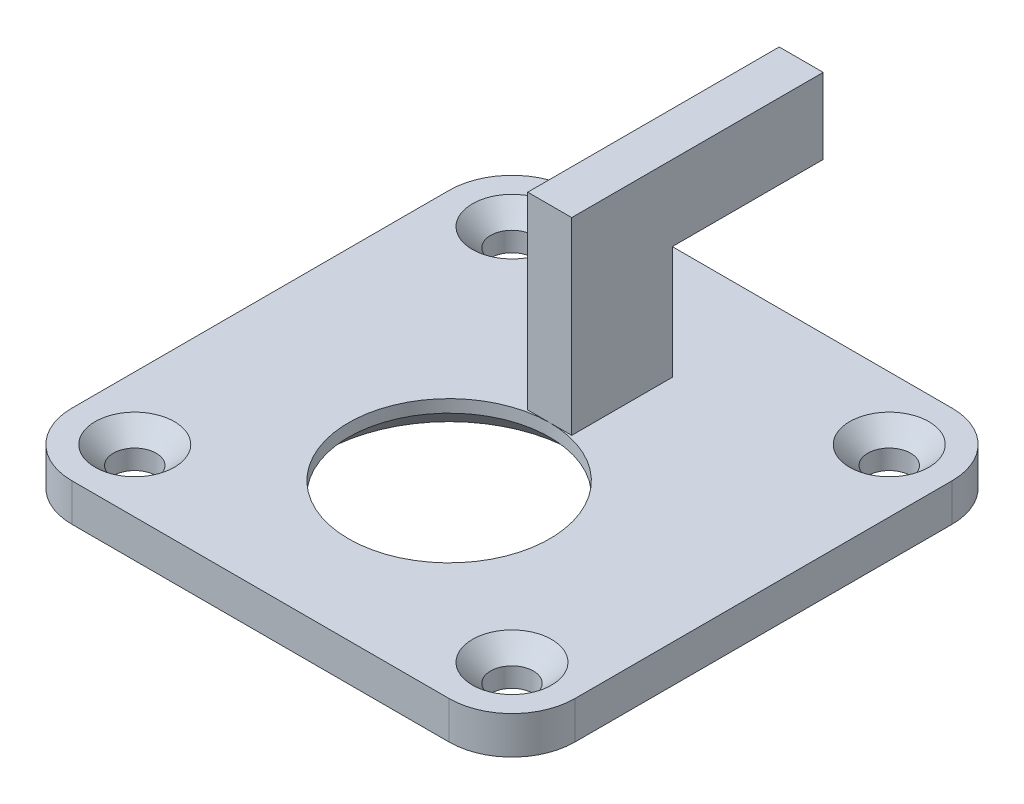
ISO-10303-21;
HEADER;
FILE_DESCRIPTION(('STEP AP214'),'2;1');
FILE_NAME('part.step','',(''),(''),'','','');
FILE_SCHEMA(('AUTOMOTIVE_DESIGN { 1 0 10303 214 1 1 1 1 }'));
ENDSEC;
DATA;
#1=APPLICATION_CONTEXT('core data for automotive mechanical design processes');
#2=APPLICATION_PROTOCOL_DEFINITION('international standard','automotive_design',2000,#1);
#3=PRODUCT_CONTEXT('',#1,'mechanical');
#4=PRODUCT('Part','Part','',(#3));
#5=PRODUCT_RELATED_PRODUCT_CATEGORY('part','',(#4));
#6=PRODUCT_DEFINITION_FORMATION('','',#4);
#7=PRODUCT_DEFINITION_CONTEXT('part definition',#1,'design');
#8=PRODUCT_DEFINITION('design','',#6,#7);
#9=PRODUCT_DEFINITION_SHAPE('','',#8);
#10=(LENGTH_UNIT() NAMED_UNIT(*) SI_UNIT(.MILLI.,.METRE.));
#11=(NAMED_UNIT(*) PLANE_ANGLE_UNIT() SI_UNIT($,.RADIAN.));
#12=(NAMED_UNIT(*) SI_UNIT($,.STERADIAN.) SOLID_ANGLE_UNIT());
#13=UNCERTAINTY_MEASURE_WITH_UNIT(LENGTH_MEASURE(1.E-05),#10,'distance_accuracy_value','');
#14=(GEOMETRIC_REPRESENTATION_CONTEXT(3) GLOBAL_UNCERTAINTY_ASSIGNED_CONTEXT((#13)) GLOBAL_UNIT_ASSIGNED_CONTEXT((#10,
#11,#12)) REPRESENTATION_CONTEXT('',''));
#15=CARTESIAN_POINT('',(0.,0.,0.));
#16=DIRECTION('',(0.,0.,1.));
#17=DIRECTION('',(1.,0.,0.));
#18=AXIS2_PLACEMENT_3D('',#15,#16,#17);
#19=CARTESIAN_POINT('',(15.,0.,-20.));
#20=DIRECTION('',(0.,1.,0.));
#21=DIRECTION('',(0.,0.,1.));
#22=AXIS2_PLACEMENT_3D('',#19,#20,#21);
#23=PLANE('',#22);
#24=CARTESIAN_POINT('',(-15.,0.,-20.));
#25=DIRECTION('',(0.,1.,0.));
#26=DIRECTION('',(0.,0.,1.));
#27=AXIS2_PLACEMENT_3D('',#24,#25,#26);
#28=CIRCLE('',#27,3.15);
#29=CARTESIAN_POINT('',(-15.,0.,-16.85));
#30=VERTEX_POINT('',#29);
#31=EDGE_CURVE('E291',#30,#30,#28,.T.);
#32=ORIENTED_EDGE('',*,*,#31,.F.);
#33=EDGE_LOOP('',(#32));
#34=FACE_BOUND('',#33,.T.);
#35=CARTESIAN_POINT('',(15.,0.,-20.));
#36=DIRECTION('',(0.,1.,0.));
#37=DIRECTION('',(0.,0.,1.));
#38=AXIS2_PLACEMENT_3D('',#35,#36,#37);
#39=CIRCLE('',#38,3.15);
#40=CARTESIAN_POINT('',(15.,0.,-16.85));
#41=VERTEX_POINT('',#40);
#42=EDGE_CURVE('E282',#41,#41,#39,.T.);
#43=ORIENTED_EDGE('',*,*,#42,.F.);
#44=EDGE_LOOP('',(#43));
#45=FACE_BOUND('',#44,.T.);
#46=CARTESIAN_POINT('',(15.,0.,9.99999999999999));
#47=DIRECTION('',(0.,1.,0.));
#48=DIRECTION('',(0.,0.,1.));
#49=AXIS2_PLACEMENT_3D('',#46,#47,#48);
#50=CIRCLE('',#49,3.15);
#51=CARTESIAN_POINT('',(15.,0.,13.15));
#52=VERTEX_POINT('',#51);
#53=EDGE_CURVE('E273',#52,#52,#50,.T.);
#54=ORIENTED_EDGE('',*,*,#53,.F.);
#55=EDGE_LOOP('',(#54));
#56=FACE_BOUND('',#55,.T.);
#57=CARTESIAN_POINT('',(-15.,0.,10.));
#58=DIRECTION('',(0.,1.,0.));
#59=DIRECTION('',(0.,0.,1.));
#60=AXIS2_PLACEMENT_3D('',#57,#58,#59);
#61=CIRCLE('',#60,3.15);
#62=CARTESIAN_POINT('',(-15.,0.,13.15));
#63=VERTEX_POINT('',#62);
#64=EDGE_CURVE('E264',#63,#63,#61,.T.);
#65=ORIENTED_EDGE('',*,*,#64,.F.);
#66=EDGE_LOOP('',(#65));
#67=FACE_BOUND('',#66,.T.);
#68=CARTESIAN_POINT('',(15.,0.,-20.));
#69=DIRECTION('',(0.,1.,0.));
#70=DIRECTION('',(0.,0.,1.));
#71=AXIS2_PLACEMENT_3D('',#68,#69,#70);
#72=CIRCLE('',#71,5.);
#73=CARTESIAN_POINT('',(20.,0.,-20.));
#74=VERTEX_POINT('',#73);
#75=CARTESIAN_POINT('',(15.,0.,-25.));
#76=VERTEX_POINT('',#75);
#77=EDGE_CURVE('E147',#74,#76,#72,.T.);
#78=ORIENTED_EDGE('',*,*,#77,.T.);
#79=DIRECTION('',(-1.,0.,0.));
#80=VECTOR('',#79,1.);
#81=CARTESIAN_POINT('',(-15.,0.,-25.));
#82=LINE('',#81,#80);
#83=CARTESIAN_POINT('',(-15.,0.,-25.));
#84=VERTEX_POINT('',#83);
#85=EDGE_CURVE('E150',#76,#84,#82,.T.);
#86=ORIENTED_EDGE('',*,*,#85,.T.);
#87=CARTESIAN_POINT('',(-15.,0.,-20.));
#88=DIRECTION('',(0.,1.,0.));
#89=DIRECTION('',(0.,0.,1.));
#90=AXIS2_PLACEMENT_3D('',#87,#88,#89);
#91=CIRCLE('',#90,5.);
#92=CARTESIAN_POINT('',(-20.,0.,-20.));
#93=VERTEX_POINT('',#92);
#94=EDGE_CURVE('E154',#84,#93,#91,.T.);
#95=ORIENTED_EDGE('',*,*,#94,.T.);
#96=DIRECTION('',(0.,0.,1.));
#97=VECTOR('',#96,1.);
#98=CARTESIAN_POINT('',(-20.,0.,10.));
#99=LINE('',#98,#97);
#100=CARTESIAN_POINT('',(-20.,0.,10.));
#101=VERTEX_POINT('',#100);
#102=EDGE_CURVE('E157',#93,#101,#99,.T.);
#103=ORIENTED_EDGE('',*,*,#102,.T.);
#104=CARTESIAN_POINT('',(-15.,0.,10.));
#105=DIRECTION('',(0.,1.,0.));
#106=DIRECTION('',(0.,0.,-1.));
#107=AXIS2_PLACEMENT_3D('',#104,#105,#106);
#108=CIRCLE('',#107,5.);
#109=CARTESIAN_POINT('',(-15.,0.,15.));
#110=VERTEX_POINT('',#109);
#111=EDGE_CURVE('E160',#101,#110,#108,.T.);
#112=ORIENTED_EDGE('',*,*,#111,.T.);
#113=DIRECTION('',(1.,0.,0.));
#114=VECTOR('',#113,1.);
#115=CARTESIAN_POINT('',(-15.,0.,15.));
#116=LINE('',#115,#114);
#117=CARTESIAN_POINT('',(15.,0.,15.));
#118=VERTEX_POINT('',#117);
#119=EDGE_CURVE('E163',#110,#118,#116,.T.);
#120=ORIENTED_EDGE('',*,*,#119,.T.);
#121=CARTESIAN_POINT('',(15.,0.,9.99999999999999));
#122=DIRECTION('',(0.,1.,0.));
#123=DIRECTION('',(0.,0.,-1.));
#124=AXIS2_PLACEMENT_3D('',#121,#122,#123);
#125=CIRCLE('',#124,5.);
#126=CARTESIAN_POINT('',(20.,0.,9.99999999999999));
#127=VERTEX_POINT('',#126);
#128=EDGE_CURVE('E123',#118,#127,#125,.T.);
#129=ORIENTED_EDGE('',*,*,#128,.T.);
#130=DIRECTION('',(0.,0.,-1.));
#131=VECTOR('',#130,1.);
#132=CARTESIAN_POINT('',(20.,0.,9.99999999999999));
#133=LINE('',#132,#131);
#134=EDGE_CURVE('E166',#127,#74,#133,.T.);
#135=ORIENTED_EDGE('',*,*,#134,.T.);
#136=EDGE_LOOP('',(#78,#86,#95,#103,#112,#120,#129,#135));
#137=FACE_BOUND('',#136,.T.);
#138=DIRECTION('',(-1.,0.,0.));
#139=VECTOR('',#138,1.);
#140=CARTESIAN_POINT('',(1.75,0.,-8.));
#141=LINE('',#140,#139);
#142=CARTESIAN_POINT('',(0.,0.,-8.));
#143=VERTEX_POINT('',#142);
#144=CARTESIAN_POINT('',(-1.75,0.,-8.));
#145=VERTEX_POINT('',#144);
#146=EDGE_CURVE('E11',#143,#145,#141,.T.);
#147=ORIENTED_EDGE('',*,*,#146,.T.);
#148=DIRECTION('',(0.,0.,-1.));
#149=VECTOR('',#148,1.);
#150=CARTESIAN_POINT('',(-1.75,0.,-16.));
#151=LINE('',#150,#149);
#152=CARTESIAN_POINT('',(-1.75,0.,-16.));
#153=VERTEX_POINT('',#152);
#154=EDGE_CURVE('E50',#145,#153,#151,.T.);
#155=ORIENTED_EDGE('',*,*,#154,.T.);
#156=DIRECTION('',(-1.,0.,0.));
#157=VECTOR('',#156,1.);
#158=CARTESIAN_POINT('',(1.75,0.,-16.));
#159=LINE('',#158,#157);
#160=CARTESIAN_POINT('',(1.75,0.,-16.));
#161=VERTEX_POINT('',#160);
#162=EDGE_CURVE('E294',#161,#153,#159,.T.);
#163=ORIENTED_EDGE('',*,*,#162,.F.);
#164=DIRECTION('',(0.,0.,-1.));
#165=VECTOR('',#164,1.);
#166=CARTESIAN_POINT('',(1.75,0.,-16.));
#167=LINE('',#166,#165);
#168=CARTESIAN_POINT('',(1.75,0.,-8.));
#169=VERTEX_POINT('',#168);
#170=EDGE_CURVE('E313',#169,#161,#167,.T.);
#171=ORIENTED_EDGE('',*,*,#170,.F.);
#172=EDGE_CURVE('E43',#169,#143,#141,.T.);
#173=ORIENTED_EDGE('',*,*,#172,.T.);
#174=CARTESIAN_POINT('',(0.,0.,0.));
#175=DIRECTION('',(0.,1.,0.));
#176=DIRECTION('',(0.,0.,1.));
#177=AXIS2_PLACEMENT_3D('',#174,#175,#176);
#178=CIRCLE('',#177,8.);
#179=EDGE_CURVE('E151',#143,#143,#178,.T.);
#180=ORIENTED_EDGE('',*,*,#179,.F.);
#181=EDGE_LOOP('',(#147,#155,#163,#171,#173,#180));
#182=FACE_BOUND('',#181,.T.);
#183=ADVANCED_FACE('F33',(#34,#45,#56,#67,#137,#182),#23,.T.);
#184=CARTESIAN_POINT('',(15.,-3.,-20.));
#185=DIRECTION('',(0.,1.,0.));
#186=DIRECTION('',(0.,0.,1.));
#187=AXIS2_PLACEMENT_3D('',#184,#185,#186);
#188=CYLINDRICAL_SURFACE('',#187,5.);
#189=ORIENTED_EDGE('',*,*,#77,.F.);
#190=DIRECTION('',(0.,1.,0.));
#191=VECTOR('',#190,1.);
#192=CARTESIAN_POINT('',(20.,-3.,-20.));
#193=LINE('',#192,#191);
#194=CARTESIAN_POINT('',(20.,-3.,-20.));
#195=VERTEX_POINT('',#194);
#196=EDGE_CURVE('E59',#195,#74,#193,.T.);
#197=ORIENTED_EDGE('',*,*,#196,.F.);
#198=CARTESIAN_POINT('',(15.,-3.,-20.));
#199=DIRECTION('',(0.,1.,0.));
#200=DIRECTION('',(0.,0.,1.));
#201=AXIS2_PLACEMENT_3D('',#198,#199,#200);
#202=CIRCLE('',#201,5.);
#203=CARTESIAN_POINT('',(15.,-3.,-25.));
#204=VERTEX_POINT('',#203);
#205=EDGE_CURVE('E169',#195,#204,#202,.T.);
#206=ORIENTED_EDGE('',*,*,#205,.T.);
#207=DIRECTION('',(0.,1.,0.));
#208=VECTOR('',#207,1.);
#209=CARTESIAN_POINT('',(15.,-3.,-25.));
#210=LINE('',#209,#208);
#211=EDGE_CURVE('E98',#204,#76,#210,.T.);
#212=ORIENTED_EDGE('',*,*,#211,.T.);
#213=EDGE_LOOP('',(#189,#197,#206,#212));
#214=FACE_BOUND('',#213,.T.);
#215=ADVANCED_FACE('F205',(#214),#188,.T.);
#216=CARTESIAN_POINT('',(20.,-3.,9.99999999999999));
#217=DIRECTION('',(1.,0.,0.));
#218=DIRECTION('',(0.,0.,-1.));
#219=AXIS2_PLACEMENT_3D('',#216,#217,#218);
#220=PLANE('',#219);
#221=ORIENTED_EDGE('',*,*,#134,.F.);
#222=DIRECTION('',(0.,1.,0.));
#223=VECTOR('',#222,1.);
#224=CARTESIAN_POINT('',(20.,-3.,9.99999999999999));
#225=LINE('',#224,#223);
#226=CARTESIAN_POINT('',(20.,-3.,9.99999999999999));
#227=VERTEX_POINT('',#226);
#228=EDGE_CURVE('E128',#227,#127,#225,.T.);
#229=ORIENTED_EDGE('',*,*,#228,.F.);
#230=DIRECTION('',(0.,0.,-1.));
#231=VECTOR('',#230,1.);
#232=CARTESIAN_POINT('',(20.,-3.,9.99999999999999));
#233=LINE('',#232,#231);
#234=EDGE_CURVE('E137',#227,#195,#233,.T.);
#235=ORIENTED_EDGE('',*,*,#234,.T.);
#236=ORIENTED_EDGE('',*,*,#196,.T.);
#237=EDGE_LOOP('',(#221,#229,#235,#236));
#238=FACE_BOUND('',#237,.T.);
#239=ADVANCED_FACE('F212',(#238),#220,.T.);
#240=CARTESIAN_POINT('',(15.,-3.,9.99999999999999));
#241=DIRECTION('',(0.,1.,0.));
#242=DIRECTION('',(0.,0.,1.));
#243=AXIS2_PLACEMENT_3D('',#240,#241,#242);
#244=CYLINDRICAL_SURFACE('',#243,5.);
#245=ORIENTED_EDGE('',*,*,#128,.F.);
#246=DIRECTION('',(0.,1.,0.));
#247=VECTOR('',#246,1.);
#248=CARTESIAN_POINT('',(15.,-3.,15.));
#249=LINE('',#248,#247);
#250=CARTESIAN_POINT('',(15.,-3.,15.));
#251=VERTEX_POINT('',#250);
#252=EDGE_CURVE('E117',#251,#118,#249,.T.);
#253=ORIENTED_EDGE('',*,*,#252,.F.);
#254=CARTESIAN_POINT('',(15.,-3.,9.99999999999999));
#255=DIRECTION('',(0.,1.,0.));
#256=DIRECTION('',(0.,0.,-1.));
#257=AXIS2_PLACEMENT_3D('',#254,#255,#256);
#258=CIRCLE('',#257,5.);
#259=EDGE_CURVE('E120',#251,#227,#258,.T.);
#260=ORIENTED_EDGE('',*,*,#259,.T.);
#261=ORIENTED_EDGE('',*,*,#228,.T.);
#262=EDGE_LOOP('',(#245,#253,#260,#261));
#263=FACE_BOUND('',#262,.T.);
#264=ADVANCED_FACE('F119',(#263),#244,.T.);
#265=CARTESIAN_POINT('',(-15.,-3.,15.));
#266=DIRECTION('',(0.,0.,1.));
#267=DIRECTION('',(1.,0.,0.));
#268=AXIS2_PLACEMENT_3D('',#265,#266,#267);
#269=PLANE('',#268);
#270=ORIENTED_EDGE('',*,*,#119,.F.);
#271=DIRECTION('',(0.,1.,0.));
#272=VECTOR('',#271,1.);
#273=CARTESIAN_POINT('',(-15.,-3.,15.));
#274=LINE('',#273,#272);
#275=CARTESIAN_POINT('',(-15.,-3.,15.));
#276=VERTEX_POINT('',#275);
#277=EDGE_CURVE('E129',#276,#110,#274,.T.);
#278=ORIENTED_EDGE('',*,*,#277,.F.);
#279=DIRECTION('',(1.,0.,0.));
#280=VECTOR('',#279,1.);
#281=CARTESIAN_POINT('',(-15.,-3.,15.));
#282=LINE('',#281,#280);
#283=EDGE_CURVE('E135',#276,#251,#282,.T.);
#284=ORIENTED_EDGE('',*,*,#283,.T.);
#285=ORIENTED_EDGE('',*,*,#252,.T.);
#286=EDGE_LOOP('',(#270,#278,#284,#285));
#287=FACE_BOUND('',#286,.T.);
#288=ADVANCED_FACE('F139',(#287),#269,.T.);
#289=CARTESIAN_POINT('',(-15.,-3.,10.));
#290=DIRECTION('',(0.,1.,0.));
#291=DIRECTION('',(0.,0.,1.));
#292=AXIS2_PLACEMENT_3D('',#289,#290,#291);
#293=CYLINDRICAL_SURFACE('',#292,5.);
#294=ORIENTED_EDGE('',*,*,#111,.F.);
#295=DIRECTION('',(0.,1.,0.));
#296=VECTOR('',#295,1.);
#297=CARTESIAN_POINT('',(-20.,-3.,10.));
#298=LINE('',#297,#296);
#299=CARTESIAN_POINT('',(-20.,-3.,10.));
#300=VERTEX_POINT('',#299);
#301=EDGE_CURVE('E174',#300,#101,#298,.T.);
#302=ORIENTED_EDGE('',*,*,#301,.F.);
#303=CARTESIAN_POINT('',(-15.,-3.,10.));
#304=DIRECTION('',(0.,1.,0.));
#305=DIRECTION('',(0.,0.,-1.));
#306=AXIS2_PLACEMENT_3D('',#303,#304,#305);
#307=CIRCLE('',#306,5.);
#308=EDGE_CURVE('E140',#300,#276,#307,.T.);
#309=ORIENTED_EDGE('',*,*,#308,.T.);
#310=ORIENTED_EDGE('',*,*,#277,.T.);
#311=EDGE_LOOP('',(#294,#302,#309,#310));
#312=FACE_BOUND('',#311,.T.);
#313=ADVANCED_FACE('F224',(#312),#293,.T.);
#314=CARTESIAN_POINT('',(-20.,-3.,10.));
#315=DIRECTION('',(-1.,0.,0.));
#316=DIRECTION('',(0.,0.,1.));
#317=AXIS2_PLACEMENT_3D('',#314,#315,#316);
#318=PLANE('',#317);
#319=ORIENTED_EDGE('',*,*,#102,.F.);
#320=DIRECTION('',(0.,1.,0.));
#321=VECTOR('',#320,1.);
#322=CARTESIAN_POINT('',(-20.,-3.,-20.));
#323=LINE('',#322,#321);
#324=CARTESIAN_POINT('',(-20.,-3.,-20.));
#325=VERTEX_POINT('',#324);
#326=EDGE_CURVE('E176',#325,#93,#323,.T.);
#327=ORIENTED_EDGE('',*,*,#326,.F.);
#328=DIRECTION('',(0.,0.,1.));
#329=VECTOR('',#328,1.);
#330=CARTESIAN_POINT('',(-20.,-3.,10.));
#331=LINE('',#330,#329);
#332=EDGE_CURVE('E142',#325,#300,#331,.T.);
#333=ORIENTED_EDGE('',*,*,#332,.T.);
#334=ORIENTED_EDGE('',*,*,#301,.T.);
#335=EDGE_LOOP('',(#319,#327,#333,#334));
#336=FACE_BOUND('',#335,.T.);
#337=ADVANCED_FACE('F227',(#336),#318,.T.);
#338=CARTESIAN_POINT('',(-15.,-3.,-20.));
#339=DIRECTION('',(0.,1.,0.));
#340=DIRECTION('',(0.,0.,1.));
#341=AXIS2_PLACEMENT_3D('',#338,#339,#340);
#342=CYLINDRICAL_SURFACE('',#341,5.);
#343=ORIENTED_EDGE('',*,*,#94,.F.);
#344=DIRECTION('',(0.,1.,0.));
#345=VECTOR('',#344,1.);
#346=CARTESIAN_POINT('',(-15.,-3.,-25.));
#347=LINE('',#346,#345);
#348=CARTESIAN_POINT('',(-15.,-3.,-25.));
#349=VERTEX_POINT('',#348);
#350=EDGE_CURVE('E178',#349,#84,#347,.T.);
#351=ORIENTED_EDGE('',*,*,#350,.F.);
#352=CARTESIAN_POINT('',(-15.,-3.,-20.));
#353=DIRECTION('',(0.,1.,0.));
#354=DIRECTION('',(0.,0.,1.));
#355=AXIS2_PLACEMENT_3D('',#352,#353,#354);
#356=CIRCLE('',#355,5.);
#357=EDGE_CURVE('E246',#349,#325,#356,.T.);
#358=ORIENTED_EDGE('',*,*,#357,.T.);
#359=ORIENTED_EDGE('',*,*,#326,.T.);
#360=EDGE_LOOP('',(#343,#351,#358,#359));
#361=FACE_BOUND('',#360,.T.);
#362=ADVANCED_FACE('F231',(#361),#342,.T.);
#363=CARTESIAN_POINT('',(-15.,-3.,-25.));
#364=DIRECTION('',(0.,0.,-1.));
#365=DIRECTION('',(-1.,0.,0.));
#366=AXIS2_PLACEMENT_3D('',#363,#364,#365);
#367=PLANE('',#366);
#368=ORIENTED_EDGE('',*,*,#85,.F.);
#369=ORIENTED_EDGE('',*,*,#211,.F.);
#370=DIRECTION('',(-1.,0.,0.));
#371=VECTOR('',#370,1.);
#372=CARTESIAN_POINT('',(-15.,-3.,-25.));
#373=LINE('',#372,#371);
#374=EDGE_CURVE('E244',#204,#349,#373,.T.);
#375=ORIENTED_EDGE('',*,*,#374,.T.);
#376=ORIENTED_EDGE('',*,*,#350,.T.);
#377=EDGE_LOOP('',(#368,#369,#375,#376));
#378=FACE_BOUND('',#377,.T.);
#379=ADVANCED_FACE('F235',(#378),#367,.T.);
#380=CARTESIAN_POINT('',(15.,-3.,-20.));
#381=DIRECTION('',(0.,1.,0.));
#382=DIRECTION('',(0.,0.,1.));
#383=AXIS2_PLACEMENT_3D('',#380,#381,#382);
#384=PLANE('',#383);
#385=CARTESIAN_POINT('',(0.,-3.,0.));
#386=DIRECTION('',(0.,1.,0.));
#387=DIRECTION('',(0.,0.,1.));
#388=AXIS2_PLACEMENT_3D('',#385,#386,#387);
#389=CIRCLE('',#388,10.);
#390=CARTESIAN_POINT('',(0.,-3.,10.));
#391=VERTEX_POINT('',#390);
#392=EDGE_CURVE('E171',#391,#391,#389,.T.);
#393=ORIENTED_EDGE('',*,*,#392,.T.);
#394=EDGE_LOOP('',(#393));
#395=FACE_BOUND('',#394,.T.);
#396=CARTESIAN_POINT('',(-15.,-3.,-20.));
#397=DIRECTION('',(0.,1.,0.));
#398=DIRECTION('',(0.,0.,1.));
#399=AXIS2_PLACEMENT_3D('',#396,#397,#398);
#400=CIRCLE('',#399,1.7);
#401=CARTESIAN_POINT('',(-15.,-3.,-18.3));
#402=VERTEX_POINT('',#401);
#403=EDGE_CURVE('E285',#402,#402,#400,.T.);
#404=ORIENTED_EDGE('',*,*,#403,.T.);
#405=EDGE_LOOP('',(#404));
#406=FACE_BOUND('',#405,.T.);
#407=CARTESIAN_POINT('',(15.,-3.,-20.));
#408=DIRECTION('',(0.,1.,0.));
#409=DIRECTION('',(0.,0.,1.));
#410=AXIS2_PLACEMENT_3D('',#407,#408,#409);
#411=CIRCLE('',#410,1.7);
#412=CARTESIAN_POINT('',(15.,-3.,-18.3));
#413=VERTEX_POINT('',#412);
#414=EDGE_CURVE('E276',#413,#413,#411,.T.);
#415=ORIENTED_EDGE('',*,*,#414,.T.);
#416=EDGE_LOOP('',(#415));
#417=FACE_BOUND('',#416,.T.);
#418=CARTESIAN_POINT('',(15.,-3.,9.99999999999999));
#419=DIRECTION('',(0.,1.,0.));
#420=DIRECTION('',(0.,0.,1.));
#421=AXIS2_PLACEMENT_3D('',#418,#419,#420);
#422=CIRCLE('',#421,1.7);
#423=CARTESIAN_POINT('',(15.,-3.,11.7));
#424=VERTEX_POINT('',#423);
#425=EDGE_CURVE('E267',#424,#424,#422,.T.);
#426=ORIENTED_EDGE('',*,*,#425,.T.);
#427=EDGE_LOOP('',(#426));
#428=FACE_BOUND('',#427,.T.);
#429=CARTESIAN_POINT('',(-15.,-3.,10.));
#430=DIRECTION('',(0.,1.,0.));
#431=DIRECTION('',(0.,0.,1.));
#432=AXIS2_PLACEMENT_3D('',#429,#430,#431);
#433=CIRCLE('',#432,1.7);
#434=CARTESIAN_POINT('',(-15.,-3.,11.7));
#435=VERTEX_POINT('',#434);
#436=EDGE_CURVE('E258',#435,#435,#433,.T.);
#437=ORIENTED_EDGE('',*,*,#436,.T.);
#438=EDGE_LOOP('',(#437));
#439=FACE_BOUND('',#438,.T.);
#440=ORIENTED_EDGE('',*,*,#205,.F.);
#441=ORIENTED_EDGE('',*,*,#234,.F.);
#442=ORIENTED_EDGE('',*,*,#259,.F.);
#443=ORIENTED_EDGE('',*,*,#283,.F.);
#444=ORIENTED_EDGE('',*,*,#308,.F.);
#445=ORIENTED_EDGE('',*,*,#332,.F.);
#446=ORIENTED_EDGE('',*,*,#357,.F.);
#447=ORIENTED_EDGE('',*,*,#374,.F.);
#448=EDGE_LOOP('',(#440,#441,#442,#443,#444,#445,#446,#447));
#449=FACE_BOUND('',#448,.T.);
#450=ADVANCED_FACE('F133',(#395,#406,#417,#428,#439,#449),#384,.F.);
#451=CARTESIAN_POINT('',(0.,-3.,0.));
#452=DIRECTION('',(0.,1.,0.));
#453=DIRECTION('',(0.,0.,1.));
#454=AXIS2_PLACEMENT_3D('',#451,#452,#453);
#455=CYLINDRICAL_SURFACE('',#454,8.);
#456=CARTESIAN_POINT('',(0.,-0.999999999999991,0.));
#457=DIRECTION('',(0.,1.,0.));
#458=DIRECTION('',(0.,0.,1.));
#459=AXIS2_PLACEMENT_3D('',#456,#457,#458);
#460=CIRCLE('',#459,8.);
#461=CARTESIAN_POINT('',(0.,-0.999999999999991,8.));
#462=VERTEX_POINT('',#461);
#463=EDGE_CURVE('E37',#462,#462,#460,.F.);
#464=ORIENTED_EDGE('',*,*,#463,.T.);
#465=EDGE_LOOP('',(#464));
#466=FACE_BOUND('',#465,.T.);
#467=ORIENTED_EDGE('',*,*,#179,.T.);
#468=EDGE_LOOP('',(#467));
#469=FACE_BOUND('',#468,.T.);
#470=ADVANCED_FACE('F186',(#466,#469),#455,.F.);
#471=CARTESIAN_POINT('',(-15.,0.,10.));
#472=DIRECTION('',(0.,1.,0.));
#473=DIRECTION('',(0.,0.,1.));
#474=AXIS2_PLACEMENT_3D('',#471,#472,#473);
#475=CYLINDRICAL_SURFACE('',#474,1.7);
#476=ORIENTED_EDGE('',*,*,#436,.F.);
#477=EDGE_LOOP('',(#476));
#478=FACE_BOUND('',#477,.T.);
#479=CARTESIAN_POINT('',(-15.,-1.45,10.));
#480=DIRECTION('',(0.,1.,0.));
#481=DIRECTION('',(0.,0.,1.));
#482=AXIS2_PLACEMENT_3D('',#479,#480,#481);
#483=CIRCLE('',#482,1.7);
#484=CARTESIAN_POINT('',(-15.,-1.45,11.7));
#485=VERTEX_POINT('',#484);
#486=EDGE_CURVE('E261',#485,#485,#483,.T.);
#487=ORIENTED_EDGE('',*,*,#486,.T.);
#488=EDGE_LOOP('',(#487));
#489=FACE_BOUND('',#488,.T.);
#490=ADVANCED_FACE('F418',(#478,#489),#475,.F.);
#491=CARTESIAN_POINT('',(-15.,0.,10.));
#492=DIRECTION('',(0.,1.,0.));
#493=DIRECTION('',(0.,0.,1.));
#494=AXIS2_PLACEMENT_3D('',#491,#492,#493);
#495=CONICAL_SURFACE('',#494,3.15,0.785398163397448);
#496=ORIENTED_EDGE('',*,*,#486,.F.);
#497=EDGE_LOOP('',(#496));
#498=FACE_BOUND('',#497,.T.);
#499=ORIENTED_EDGE('',*,*,#64,.T.);
#500=EDGE_LOOP('',(#499));
#501=FACE_BOUND('',#500,.T.);
#502=ADVANCED_FACE('F414',(#498,#501),#495,.F.);
#503=CARTESIAN_POINT('',(15.,0.,9.99999999999999));
#504=DIRECTION('',(0.,1.,0.));
#505=DIRECTION('',(0.,0.,1.));
#506=AXIS2_PLACEMENT_3D('',#503,#504,#505);
#507=CYLINDRICAL_SURFACE('',#506,1.7);
#508=ORIENTED_EDGE('',*,*,#425,.F.);
#509=EDGE_LOOP('',(#508));
#510=FACE_BOUND('',#509,.T.);
#511=CARTESIAN_POINT('',(15.,-1.45,9.99999999999999));
#512=DIRECTION('',(0.,1.,0.));
#513=DIRECTION('',(0.,0.,1.));
#514=AXIS2_PLACEMENT_3D('',#511,#512,#513);
#515=CIRCLE('',#514,1.7);
#516=CARTESIAN_POINT('',(15.,-1.45,11.7));
#517=VERTEX_POINT('',#516);
#518=EDGE_CURVE('E270',#517,#517,#515,.T.);
#519=ORIENTED_EDGE('',*,*,#518,.T.);
#520=EDGE_LOOP('',(#519));
#521=FACE_BOUND('',#520,.T.);
#522=ADVANCED_FACE('F410',(#510,#521),#507,.F.);
#523=CARTESIAN_POINT('',(15.,0.,9.99999999999999));
#524=DIRECTION('',(0.,1.,0.));
#525=DIRECTION('',(0.,0.,1.));
#526=AXIS2_PLACEMENT_3D('',#523,#524,#525);
#527=CONICAL_SURFACE('',#526,3.15,0.785398163397447);
#528=ORIENTED_EDGE('',*,*,#518,.F.);
#529=EDGE_LOOP('',(#528));
#530=FACE_BOUND('',#529,.T.);
#531=ORIENTED_EDGE('',*,*,#53,.T.);
#532=EDGE_LOOP('',(#531));
#533=FACE_BOUND('',#532,.T.);
#534=ADVANCED_FACE('F406',(#530,#533),#527,.F.);
#535=CARTESIAN_POINT('',(15.,0.,-20.));
#536=DIRECTION('',(0.,1.,0.));
#537=DIRECTION('',(0.,0.,1.));
#538=AXIS2_PLACEMENT_3D('',#535,#536,#537);
#539=CYLINDRICAL_SURFACE('',#538,1.7);
#540=ORIENTED_EDGE('',*,*,#414,.F.);
#541=EDGE_LOOP('',(#540));
#542=FACE_BOUND('',#541,.T.);
#543=CARTESIAN_POINT('',(15.,-1.45,-20.));
#544=DIRECTION('',(0.,1.,0.));
#545=DIRECTION('',(0.,0.,1.));
#546=AXIS2_PLACEMENT_3D('',#543,#544,#545);
#547=CIRCLE('',#546,1.7);
#548=CARTESIAN_POINT('',(15.,-1.45,-18.3));
#549=VERTEX_POINT('',#548);
#550=EDGE_CURVE('E279',#549,#549,#547,.T.);
#551=ORIENTED_EDGE('',*,*,#550,.T.);
#552=EDGE_LOOP('',(#551));
#553=FACE_BOUND('',#552,.T.);
#554=ADVANCED_FACE('F402',(#542,#553),#539,.F.);
#555=CARTESIAN_POINT('',(15.,0.,-20.));
#556=DIRECTION('',(0.,1.,0.));
#557=DIRECTION('',(0.,0.,1.));
#558=AXIS2_PLACEMENT_3D('',#555,#556,#557);
#559=CONICAL_SURFACE('',#558,3.15,0.785398163397447);
#560=ORIENTED_EDGE('',*,*,#550,.F.);
#561=EDGE_LOOP('',(#560));
#562=FACE_BOUND('',#561,.T.);
#563=ORIENTED_EDGE('',*,*,#42,.T.);
#564=EDGE_LOOP('',(#563));
#565=FACE_BOUND('',#564,.T.);
#566=ADVANCED_FACE('F398',(#562,#565),#559,.F.);
#567=CARTESIAN_POINT('',(-15.,0.,-20.));
#568=DIRECTION('',(0.,1.,0.));
#569=DIRECTION('',(0.,0.,1.));
#570=AXIS2_PLACEMENT_3D('',#567,#568,#569);
#571=CYLINDRICAL_SURFACE('',#570,1.7);
#572=ORIENTED_EDGE('',*,*,#403,.F.);
#573=EDGE_LOOP('',(#572));
#574=FACE_BOUND('',#573,.T.);
#575=CARTESIAN_POINT('',(-15.,-1.45,-20.));
#576=DIRECTION('',(0.,1.,0.));
#577=DIRECTION('',(0.,0.,1.));
#578=AXIS2_PLACEMENT_3D('',#575,#576,#577);
#579=CIRCLE('',#578,1.7);
#580=CARTESIAN_POINT('',(-15.,-1.45,-18.3));
#581=VERTEX_POINT('',#580);
#582=EDGE_CURVE('E288',#581,#581,#579,.T.);
#583=ORIENTED_EDGE('',*,*,#582,.T.);
#584=EDGE_LOOP('',(#583));
#585=FACE_BOUND('',#584,.T.);
#586=ADVANCED_FACE('F201',(#574,#585),#571,.F.);
#587=CARTESIAN_POINT('',(-15.,0.,-20.));
#588=DIRECTION('',(0.,1.,0.));
#589=DIRECTION('',(0.,0.,1.));
#590=AXIS2_PLACEMENT_3D('',#587,#588,#589);
#591=CONICAL_SURFACE('',#590,3.15,0.785398163397447);
#592=ORIENTED_EDGE('',*,*,#582,.F.);
#593=EDGE_LOOP('',(#592));
#594=FACE_BOUND('',#593,.T.);
#595=ORIENTED_EDGE('',*,*,#31,.T.);
#596=EDGE_LOOP('',(#595));
#597=FACE_BOUND('',#596,.T.);
#598=ADVANCED_FACE('F192',(#594,#597),#591,.F.);
#599=CARTESIAN_POINT('',(0.,-3.,0.));
#600=DIRECTION('',(0.,-1.,0.));
#601=DIRECTION('',(0.,0.,-1.));
#602=AXIS2_PLACEMENT_3D('',#599,#600,#601);
#603=CONICAL_SURFACE('',#602,10.,0.785398163397447);
#604=ORIENTED_EDGE('',*,*,#463,.F.);
#605=EDGE_LOOP('',(#604));
#606=FACE_BOUND('',#605,.T.);
#607=ORIENTED_EDGE('',*,*,#392,.F.);
#608=EDGE_LOOP('',(#607));
#609=FACE_BOUND('',#608,.T.);
#610=ADVANCED_FACE('F35',(#606,#609),#603,.F.);
#611=CARTESIAN_POINT('',(1.75,9.,-16.));
#612=DIRECTION('',(0.,0.,1.));
#613=DIRECTION('',(1.,0.,0.));
#614=AXIS2_PLACEMENT_3D('',#611,#612,#613);
#615=PLANE('',#614);
#616=DIRECTION('',(0.,1.,0.));
#617=VECTOR('',#616,1.);
#618=CARTESIAN_POINT('',(-1.75,9.,-16.));
#619=LINE('',#618,#617);
#620=CARTESIAN_POINT('',(-1.75,9.,-16.));
#621=VERTEX_POINT('',#620);
#622=EDGE_CURVE('E323',#153,#621,#619,.T.);
#623=ORIENTED_EDGE('',*,*,#622,.T.);
#624=DIRECTION('',(-1.,0.,0.));
#625=VECTOR('',#624,1.);
#626=CARTESIAN_POINT('',(1.75,9.,-16.));
#627=LINE('',#626,#625);
#628=CARTESIAN_POINT('',(1.75,9.,-16.));
#629=VERTEX_POINT('',#628);
#630=EDGE_CURVE('E297',#629,#621,#627,.T.);
#631=ORIENTED_EDGE('',*,*,#630,.F.);
#632=DIRECTION('',(0.,1.,0.));
#633=VECTOR('',#632,1.);
#634=CARTESIAN_POINT('',(1.75,9.,-16.));
#635=LINE('',#634,#633);
#636=EDGE_CURVE('E338',#161,#629,#635,.T.);
#637=ORIENTED_EDGE('',*,*,#636,.F.);
#638=ORIENTED_EDGE('',*,*,#162,.T.);
#639=EDGE_LOOP('',(#623,#631,#637,#638));
#640=FACE_BOUND('',#639,.T.);
#641=ADVANCED_FACE('F191',(#640),#615,.F.);
#642=CARTESIAN_POINT('',(1.75,9.,-28.));
#643=DIRECTION('',(0.,1.,0.));
#644=DIRECTION('',(0.,0.,1.));
#645=AXIS2_PLACEMENT_3D('',#642,#643,#644);
#646=PLANE('',#645);
#647=DIRECTION('',(0.,0.,-1.));
#648=VECTOR('',#647,1.);
#649=CARTESIAN_POINT('',(-1.75,9.,-28.));
#650=LINE('',#649,#648);
#651=CARTESIAN_POINT('',(-1.75,9.,-28.));
#652=VERTEX_POINT('',#651);
#653=EDGE_CURVE('E320',#621,#652,#650,.T.);
#654=ORIENTED_EDGE('',*,*,#653,.T.);
#655=DIRECTION('',(-1.,0.,0.));
#656=VECTOR('',#655,1.);
#657=CARTESIAN_POINT('',(1.75,9.,-28.));
#658=LINE('',#657,#656);
#659=CARTESIAN_POINT('',(1.75,9.,-28.));
#660=VERTEX_POINT('',#659);
#661=EDGE_CURVE('E300',#660,#652,#658,.T.);
#662=ORIENTED_EDGE('',*,*,#661,.F.);
#663=DIRECTION('',(0.,0.,-1.));
#664=VECTOR('',#663,1.);
#665=CARTESIAN_POINT('',(1.75,9.,-28.));
#666=LINE('',#665,#664);
#667=EDGE_CURVE('E335',#629,#660,#666,.T.);
#668=ORIENTED_EDGE('',*,*,#667,.F.);
#669=ORIENTED_EDGE('',*,*,#630,.T.);
#670=EDGE_LOOP('',(#654,#662,#668,#669));
#671=FACE_BOUND('',#670,.T.);
#672=ADVANCED_FACE('F198',(#671),#646,.F.);
#673=CARTESIAN_POINT('',(1.75,15.,-28.));
#674=DIRECTION('',(0.,0.,1.));
#675=DIRECTION('',(1.,0.,0.));
#676=AXIS2_PLACEMENT_3D('',#673,#674,#675);
#677=PLANE('',#676);
#678=DIRECTION('',(0.,1.,0.));
#679=VECTOR('',#678,1.);
#680=CARTESIAN_POINT('',(-1.75,15.,-28.));
#681=LINE('',#680,#679);
#682=CARTESIAN_POINT('',(-1.75,15.,-28.));
#683=VERTEX_POINT('',#682);
#684=EDGE_CURVE('E317',#652,#683,#681,.T.);
#685=ORIENTED_EDGE('',*,*,#684,.T.);
#686=DIRECTION('',(-1.,0.,0.));
#687=VECTOR('',#686,1.);
#688=CARTESIAN_POINT('',(1.75,15.,-28.));
#689=LINE('',#688,#687);
#690=CARTESIAN_POINT('',(1.75,15.,-28.));
#691=VERTEX_POINT('',#690);
#692=EDGE_CURVE('E303',#691,#683,#689,.T.);
#693=ORIENTED_EDGE('',*,*,#692,.F.);
#694=DIRECTION('',(0.,1.,0.));
#695=VECTOR('',#694,1.);
#696=CARTESIAN_POINT('',(1.75,15.,-28.));
#697=LINE('',#696,#695);
#698=EDGE_CURVE('E332',#660,#691,#697,.T.);
#699=ORIENTED_EDGE('',*,*,#698,.F.);
#700=ORIENTED_EDGE('',*,*,#661,.T.);
#701=EDGE_LOOP('',(#685,#693,#699,#700));
#702=FACE_BOUND('',#701,.T.);
#703=ADVANCED_FACE('F389',(#702),#677,.F.);
#704=CARTESIAN_POINT('',(1.75,15.,-8.));
#705=DIRECTION('',(0.,-1.,0.));
#706=DIRECTION('',(0.,0.,-1.));
#707=AXIS2_PLACEMENT_3D('',#704,#705,#706);
#708=PLANE('',#707);
#709=DIRECTION('',(0.,0.,1.));
#710=VECTOR('',#709,1.);
#711=CARTESIAN_POINT('',(-1.75,15.,-8.));
#712=LINE('',#711,#710);
#713=CARTESIAN_POINT('',(-1.75,15.,-8.));
#714=VERTEX_POINT('',#713);
#715=EDGE_CURVE('E314',#683,#714,#712,.T.);
#716=ORIENTED_EDGE('',*,*,#715,.T.);
#717=DIRECTION('',(-1.,0.,0.));
#718=VECTOR('',#717,1.);
#719=CARTESIAN_POINT('',(1.75,15.,-8.));
#720=LINE('',#719,#718);
#721=CARTESIAN_POINT('',(1.75,15.,-8.));
#722=VERTEX_POINT('',#721);
#723=EDGE_CURVE('E306',#722,#714,#720,.T.);
#724=ORIENTED_EDGE('',*,*,#723,.F.);
#725=DIRECTION('',(0.,0.,1.));
#726=VECTOR('',#725,1.);
#727=CARTESIAN_POINT('',(1.75,15.,-8.));
#728=LINE('',#727,#726);
#729=EDGE_CURVE('E329',#691,#722,#728,.T.);
#730=ORIENTED_EDGE('',*,*,#729,.F.);
#731=ORIENTED_EDGE('',*,*,#692,.T.);
#732=EDGE_LOOP('',(#716,#724,#730,#731));
#733=FACE_BOUND('',#732,.T.);
#734=ADVANCED_FACE('F369',(#733),#708,.F.);
#735=CARTESIAN_POINT('',(1.75,0.,-8.));
#736=DIRECTION('',(0.,0.,-1.));
#737=DIRECTION('',(-1.,0.,0.));
#738=AXIS2_PLACEMENT_3D('',#735,#736,#737);
#739=PLANE('',#738);
#740=DIRECTION('',(0.,-1.,0.));
#741=VECTOR('',#740,1.);
#742=CARTESIAN_POINT('',(-1.75,0.,-8.));
#743=LINE('',#742,#741);
#744=EDGE_CURVE('E311',#714,#145,#743,.T.);
#745=ORIENTED_EDGE('',*,*,#744,.T.);
#746=ORIENTED_EDGE('',*,*,#146,.F.);
#747=ORIENTED_EDGE('',*,*,#172,.F.);
#748=DIRECTION('',(0.,-1.,0.));
#749=VECTOR('',#748,1.);
#750=CARTESIAN_POINT('',(1.75,0.,-8.));
#751=LINE('',#750,#749);
#752=EDGE_CURVE('E310',#722,#169,#751,.T.);
#753=ORIENTED_EDGE('',*,*,#752,.F.);
#754=ORIENTED_EDGE('',*,*,#723,.T.);
#755=EDGE_LOOP('',(#745,#746,#747,#753,#754));
#756=FACE_BOUND('',#755,.T.);
#757=ADVANCED_FACE('F375',(#756),#739,.F.);
#758=CARTESIAN_POINT('',(1.75,0.,0.));
#759=DIRECTION('',(-1.,0.,0.));
#760=DIRECTION('',(0.,0.,1.));
#761=AXIS2_PLACEMENT_3D('',#758,#759,#760);
#762=PLANE('',#761);
#763=ORIENTED_EDGE('',*,*,#170,.T.);
#764=ORIENTED_EDGE('',*,*,#636,.T.);
#765=ORIENTED_EDGE('',*,*,#667,.T.);
#766=ORIENTED_EDGE('',*,*,#698,.T.);
#767=ORIENTED_EDGE('',*,*,#729,.T.);
#768=ORIENTED_EDGE('',*,*,#752,.T.);
#769=EDGE_LOOP('',(#763,#764,#765,#766,#767,#768));
#770=FACE_BOUND('',#769,.T.);
#771=ADVANCED_FACE('F346',(#770),#762,.F.);
#772=CARTESIAN_POINT('',(-1.75,0.,0.));
#773=DIRECTION('',(-1.,0.,0.));
#774=DIRECTION('',(0.,0.,1.));
#775=AXIS2_PLACEMENT_3D('',#772,#773,#774);
#776=PLANE('',#775);
#777=ORIENTED_EDGE('',*,*,#154,.F.);
#778=ORIENTED_EDGE('',*,*,#744,.F.);
#779=ORIENTED_EDGE('',*,*,#715,.F.);
#780=ORIENTED_EDGE('',*,*,#684,.F.);
#781=ORIENTED_EDGE('',*,*,#653,.F.);
#782=ORIENTED_EDGE('',*,*,#622,.F.);
#783=EDGE_LOOP('',(#777,#778,#779,#780,#781,#782));
#784=FACE_BOUND('',#783,.T.);
#785=ADVANCED_FACE('F377',(#784),#776,.T.);
#786=CLOSED_SHELL('',(#183,#215,#239,#264,#288,#313,#337,#362,#379,#450,#470,#490,#502,#522,
#534,#554,#566,#586,#598,#610,#641,#672,#703,#734,#757,#771,#785));
#787=MANIFOLD_SOLID_BREP('B2',#786);
#788=ADVANCED_BREP_SHAPE_REPRESENTATION('',(#18,#787),#14);
#789=SHAPE_DEFINITION_REPRESENTATION(#9,#788);
ENDSEC;
END-ISO-10303-21;
